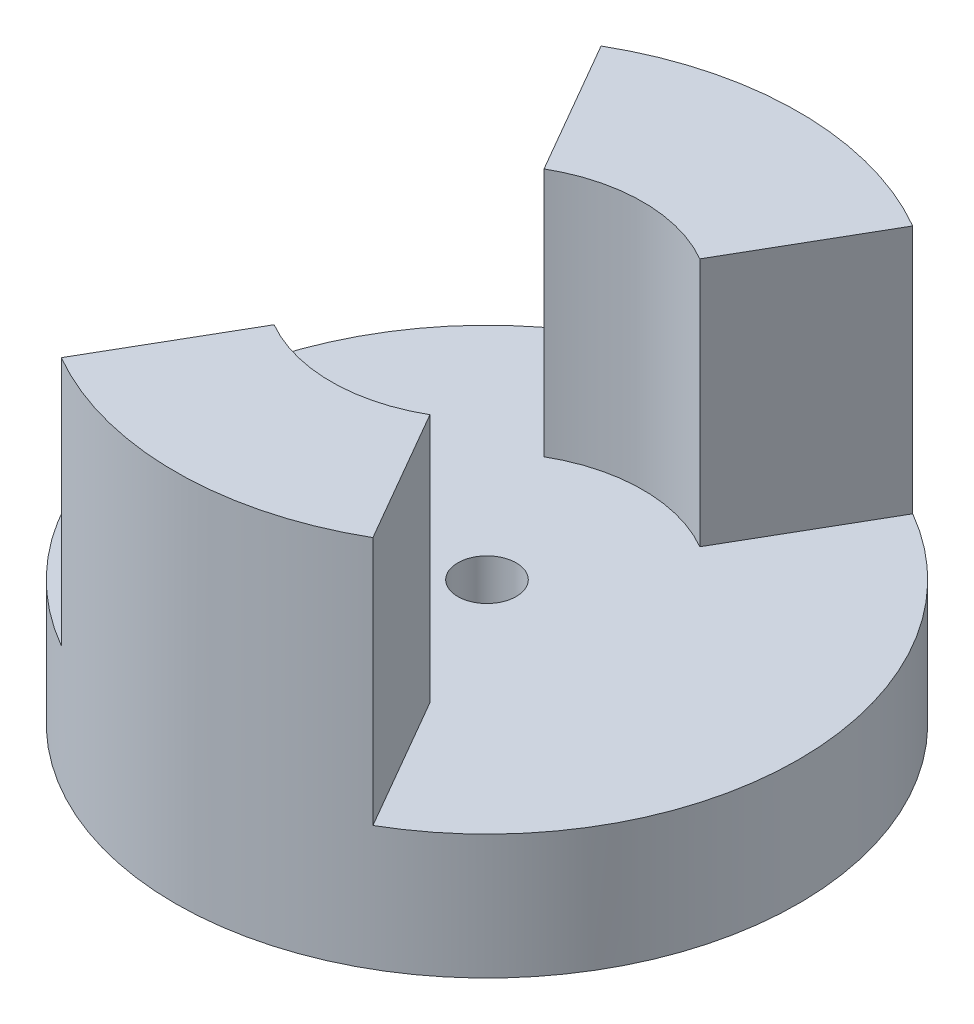
ISO-10303-21;
HEADER;
FILE_DESCRIPTION(('STEP AP214'),'2;1');
FILE_NAME('part.step','',(''),(''),'','','');
FILE_SCHEMA(('AUTOMOTIVE_DESIGN { 1 0 10303 214 1 1 1 1 }'));
ENDSEC;
DATA;
#1=APPLICATION_CONTEXT('core data for automotive mechanical design processes');
#2=APPLICATION_PROTOCOL_DEFINITION('international standard','automotive_design',2000,#1);
#3=PRODUCT_CONTEXT('',#1,'mechanical');
#4=PRODUCT('Part','Part','',(#3));
#5=PRODUCT_RELATED_PRODUCT_CATEGORY('part','',(#4));
#6=PRODUCT_DEFINITION_FORMATION('','',#4);
#7=PRODUCT_DEFINITION_CONTEXT('part definition',#1,'design');
#8=PRODUCT_DEFINITION('design','',#6,#7);
#9=PRODUCT_DEFINITION_SHAPE('','',#8);
#10=(LENGTH_UNIT() NAMED_UNIT(*) SI_UNIT(.MILLI.,.METRE.));
#11=(NAMED_UNIT(*) PLANE_ANGLE_UNIT() SI_UNIT($,.RADIAN.));
#12=(NAMED_UNIT(*) SI_UNIT($,.STERADIAN.) SOLID_ANGLE_UNIT());
#13=UNCERTAINTY_MEASURE_WITH_UNIT(LENGTH_MEASURE(1.E-05),#10,'distance_accuracy_value','');
#14=(GEOMETRIC_REPRESENTATION_CONTEXT(3) GLOBAL_UNCERTAINTY_ASSIGNED_CONTEXT((#13)) GLOBAL_UNIT_ASSIGNED_CONTEXT((#10,
#11,#12)) REPRESENTATION_CONTEXT('',''));
#15=CARTESIAN_POINT('',(0.,0.,0.));
#16=DIRECTION('',(0.,0.,1.));
#17=DIRECTION('',(1.,0.,0.));
#18=AXIS2_PLACEMENT_3D('',#15,#16,#17);
#19=CARTESIAN_POINT('',(0.,7.62,0.));
#20=DIRECTION('',(0.,-1.,0.));
#21=DIRECTION('',(0.,0.,-1.));
#22=AXIS2_PLACEMENT_3D('',#19,#20,#21);
#23=CYLINDRICAL_SURFACE('',#22,6.35);
#24=CARTESIAN_POINT('',(0.,0.,0.));
#25=DIRECTION('',(0.,1.,0.));
#26=DIRECTION('',(0.,0.,1.));
#27=AXIS2_PLACEMENT_3D('',#24,#25,#26);
#28=CIRCLE('',#27,6.35);
#29=CARTESIAN_POINT('',(0.,0.,6.35));
#30=VERTEX_POINT('',#29);
#31=EDGE_CURVE('E131',#30,#30,#28,.T.);
#32=ORIENTED_EDGE('',*,*,#31,.T.);
#33=EDGE_LOOP('',(#32));
#34=FACE_BOUND('',#33,.T.);
#35=DIRECTION('',(0.,-1.,0.));
#36=VECTOR('',#35,1.);
#37=CARTESIAN_POINT('',(3.17500000000001,7.62,-5.49926131403118));
#38=LINE('',#37,#36);
#39=CARTESIAN_POINT('',(3.17500000000001,2.54,-5.49926131403118));
#40=VERTEX_POINT('',#39);
#41=CARTESIAN_POINT('',(3.17500000000001,7.62,-5.49926131403118));
#42=VERTEX_POINT('',#41);
#43=EDGE_CURVE('E102',#40,#42,#38,.F.);
#44=ORIENTED_EDGE('',*,*,#43,.F.);
#45=CARTESIAN_POINT('',(0.,2.54,0.));
#46=DIRECTION('',(0.,-1.,0.));
#47=DIRECTION('',(0.,0.,-1.));
#48=AXIS2_PLACEMENT_3D('',#45,#46,#47);
#49=CIRCLE('',#48,6.35);
#50=CARTESIAN_POINT('',(3.17500000000002,2.54,5.49926131403118));
#51=VERTEX_POINT('',#50);
#52=EDGE_CURVE('E178',#40,#51,#49,.T.);
#53=ORIENTED_EDGE('',*,*,#52,.T.);
#54=DIRECTION('',(0.,-1.,0.));
#55=VECTOR('',#54,1.);
#56=CARTESIAN_POINT('',(3.17500000000001,7.62,5.49926131403118));
#57=LINE('',#56,#55);
#58=CARTESIAN_POINT('',(3.17500000000002,7.62,5.49926131403118));
#59=VERTEX_POINT('',#58);
#60=EDGE_CURVE('E177',#59,#51,#57,.T.);
#61=ORIENTED_EDGE('',*,*,#60,.F.);
#62=CARTESIAN_POINT('',(0.,7.62,0.));
#63=DIRECTION('',(0.,1.,0.));
#64=DIRECTION('',(0.,0.,1.));
#65=AXIS2_PLACEMENT_3D('',#62,#63,#64);
#66=CIRCLE('',#65,6.35);
#67=CARTESIAN_POINT('',(-3.17500000000002,7.62,5.49926131403118));
#68=VERTEX_POINT('',#67);
#69=EDGE_CURVE('E133',#68,#59,#66,.T.);
#70=ORIENTED_EDGE('',*,*,#69,.F.);
#71=DIRECTION('',(0.,-1.,0.));
#72=VECTOR('',#71,1.);
#73=CARTESIAN_POINT('',(-3.17500000000001,7.62,5.49926131403118));
#74=LINE('',#73,#72);
#75=CARTESIAN_POINT('',(-3.17500000000002,2.54,5.49926131403118));
#76=VERTEX_POINT('',#75);
#77=EDGE_CURVE('E123',#68,#76,#74,.T.);
#78=ORIENTED_EDGE('',*,*,#77,.T.);
#79=CARTESIAN_POINT('',(0.,2.54,0.));
#80=DIRECTION('',(0.,-1.,0.));
#81=DIRECTION('',(0.,0.,-1.));
#82=AXIS2_PLACEMENT_3D('',#79,#80,#81);
#83=CIRCLE('',#82,6.35);
#84=CARTESIAN_POINT('',(-3.17500000000001,2.54,-5.49926131403118));
#85=VERTEX_POINT('',#84);
#86=EDGE_CURVE('E172',#76,#85,#83,.T.);
#87=ORIENTED_EDGE('',*,*,#86,.T.);
#88=DIRECTION('',(0.,-1.,0.));
#89=VECTOR('',#88,1.);
#90=CARTESIAN_POINT('',(-3.17500000000001,7.62,-5.49926131403118));
#91=LINE('',#90,#89);
#92=CARTESIAN_POINT('',(-3.17500000000001,7.62,-5.49926131403118));
#93=VERTEX_POINT('',#92);
#94=EDGE_CURVE('E119',#85,#93,#91,.F.);
#95=ORIENTED_EDGE('',*,*,#94,.T.);
#96=EDGE_CURVE('E137',#42,#93,#66,.T.);
#97=ORIENTED_EDGE('',*,*,#96,.F.);
#98=EDGE_LOOP('',(#44,#53,#61,#70,#78,#87,#95,#97));
#99=FACE_BOUND('',#98,.T.);
#100=ADVANCED_FACE('F35',(#34,#99),#23,.T.);
#101=CARTESIAN_POINT('',(0.,7.62,0.));
#102=DIRECTION('',(0.,1.,0.));
#103=DIRECTION('',(0.,0.,1.));
#104=AXIS2_PLACEMENT_3D('',#101,#102,#103);
#105=PLANE('',#104);
#106=CARTESIAN_POINT('',(0.,7.62,0.));
#107=DIRECTION('',(0.,1.,0.));
#108=DIRECTION('',(0.,0.,1.));
#109=AXIS2_PLACEMENT_3D('',#106,#107,#108);
#110=CIRCLE('',#109,3.175);
#111=CARTESIAN_POINT('',(1.5875,7.62,-2.74963065701559));
#112=VERTEX_POINT('',#111);
#113=CARTESIAN_POINT('',(-1.5875,7.62,-2.74963065701559));
#114=VERTEX_POINT('',#113);
#115=EDGE_CURVE('E111',#112,#114,#110,.T.);
#116=ORIENTED_EDGE('',*,*,#115,.F.);
#117=DIRECTION('',(0.500000000000001,0.,-0.866025403784438));
#118=VECTOR('',#117,1.);
#119=CARTESIAN_POINT('',(7.62000000000001,7.62,-13.1982271536748));
#120=LINE('',#119,#118);
#121=EDGE_CURVE('E97',#112,#42,#120,.T.);
#122=ORIENTED_EDGE('',*,*,#121,.T.);
#123=ORIENTED_EDGE('',*,*,#96,.T.);
#124=DIRECTION('',(-0.500000000000001,0.,-0.866025403784438));
#125=VECTOR('',#124,1.);
#126=CARTESIAN_POINT('',(-7.62000000000001,7.62,-13.1982271536748));
#127=LINE('',#126,#125);
#128=EDGE_CURVE('E117',#114,#93,#127,.T.);
#129=ORIENTED_EDGE('',*,*,#128,.F.);
#130=EDGE_LOOP('',(#116,#122,#123,#129));
#131=FACE_BOUND('',#130,.T.);
#132=ADVANCED_FACE('F115',(#131),#105,.T.);
#133=ORIENTED_EDGE('',*,*,#69,.T.);
#134=DIRECTION('',(-0.500000000000002,0.,-0.866025403784437));
#135=VECTOR('',#134,1.);
#136=CARTESIAN_POINT('',(0.,7.62,0.));
#137=LINE('',#136,#135);
#138=CARTESIAN_POINT('',(1.58750000000001,7.62,2.74963065701559));
#139=VERTEX_POINT('',#138);
#140=EDGE_CURVE('E106',#59,#139,#137,.T.);
#141=ORIENTED_EDGE('',*,*,#140,.T.);
#142=CARTESIAN_POINT('',(-1.58750000000001,7.62,2.74963065701559));
#143=VERTEX_POINT('',#142);
#144=EDGE_CURVE('E118',#143,#139,#110,.T.);
#145=ORIENTED_EDGE('',*,*,#144,.F.);
#146=DIRECTION('',(0.500000000000002,0.,-0.866025403784437));
#147=VECTOR('',#146,1.);
#148=CARTESIAN_POINT('',(0.,7.62,0.));
#149=LINE('',#148,#147);
#150=EDGE_CURVE('E164',#68,#143,#149,.T.);
#151=ORIENTED_EDGE('',*,*,#150,.F.);
#152=EDGE_LOOP('',(#133,#141,#145,#151));
#153=FACE_BOUND('',#152,.T.);
#154=ADVANCED_FACE('F156',(#153),#105,.T.);
#155=CARTESIAN_POINT('',(0.,2.54,0.));
#156=DIRECTION('',(0.,1.,0.));
#157=DIRECTION('',(0.,0.,1.));
#158=AXIS2_PLACEMENT_3D('',#155,#156,#157);
#159=CYLINDRICAL_SURFACE('',#158,3.175);
#160=DIRECTION('',(0.,1.,0.));
#161=VECTOR('',#160,1.);
#162=CARTESIAN_POINT('',(1.5875,2.54,-2.74963065701559));
#163=LINE('',#162,#161);
#164=CARTESIAN_POINT('',(1.5875,2.54,-2.74963065701559));
#165=VERTEX_POINT('',#164);
#166=EDGE_CURVE('E11',#112,#165,#163,.F.);
#167=ORIENTED_EDGE('',*,*,#166,.F.);
#168=ORIENTED_EDGE('',*,*,#115,.T.);
#169=DIRECTION('',(0.,1.,0.));
#170=VECTOR('',#169,1.);
#171=CARTESIAN_POINT('',(-1.5875,2.54,-2.74963065701559));
#172=LINE('',#171,#170);
#173=CARTESIAN_POINT('',(-1.5875,2.54,-2.74963065701559));
#174=VERTEX_POINT('',#173);
#175=EDGE_CURVE('E144',#114,#174,#172,.F.);
#176=ORIENTED_EDGE('',*,*,#175,.T.);
#177=CARTESIAN_POINT('',(0.,2.54,0.));
#178=DIRECTION('',(0.,1.,0.));
#179=DIRECTION('',(0.,0.,1.));
#180=AXIS2_PLACEMENT_3D('',#177,#178,#179);
#181=CIRCLE('',#180,3.175);
#182=EDGE_CURVE('E113',#165,#174,#181,.T.);
#183=ORIENTED_EDGE('',*,*,#182,.F.);
#184=EDGE_LOOP('',(#167,#168,#176,#183));
#185=FACE_BOUND('',#184,.T.);
#186=ADVANCED_FACE('F109',(#185),#159,.F.);
#187=DIRECTION('',(0.,1.,0.));
#188=VECTOR('',#187,1.);
#189=CARTESIAN_POINT('',(1.58750000000001,2.54,2.74963065701559));
#190=LINE('',#189,#188);
#191=CARTESIAN_POINT('',(1.58750000000001,2.54,2.74963065701559));
#192=VERTEX_POINT('',#191);
#193=EDGE_CURVE('E42',#192,#139,#190,.T.);
#194=ORIENTED_EDGE('',*,*,#193,.F.);
#195=CARTESIAN_POINT('',(-1.58750000000001,2.54,2.74963065701559));
#196=VERTEX_POINT('',#195);
#197=EDGE_CURVE('E127',#196,#192,#181,.T.);
#198=ORIENTED_EDGE('',*,*,#197,.F.);
#199=DIRECTION('',(0.,1.,0.));
#200=VECTOR('',#199,1.);
#201=CARTESIAN_POINT('',(-1.58750000000001,2.54,2.74963065701559));
#202=LINE('',#201,#200);
#203=EDGE_CURVE('E136',#196,#143,#202,.T.);
#204=ORIENTED_EDGE('',*,*,#203,.T.);
#205=ORIENTED_EDGE('',*,*,#144,.T.);
#206=EDGE_LOOP('',(#194,#198,#204,#205));
#207=FACE_BOUND('',#206,.T.);
#208=ADVANCED_FACE('F160',(#207),#159,.F.);
#209=CARTESIAN_POINT('',(0.,7.62,0.));
#210=DIRECTION('',(0.,1.,0.));
#211=DIRECTION('',(0.,0.,1.));
#212=AXIS2_PLACEMENT_3D('',#209,#210,#211);
#213=CYLINDRICAL_SURFACE('',#212,0.595629999999993);
#214=CARTESIAN_POINT('',(0.,0.,0.));
#215=DIRECTION('',(0.,1.,0.));
#216=DIRECTION('',(0.,0.,1.));
#217=AXIS2_PLACEMENT_3D('',#214,#215,#216);
#218=CIRCLE('',#217,0.595629999999998);
#219=CARTESIAN_POINT('',(0.,0.,0.595629999999998));
#220=VERTEX_POINT('',#219);
#221=EDGE_CURVE('E128',#220,#220,#218,.T.);
#222=ORIENTED_EDGE('',*,*,#221,.F.);
#223=EDGE_LOOP('',(#222));
#224=FACE_BOUND('',#223,.T.);
#225=CARTESIAN_POINT('',(0.,2.54,0.));
#226=DIRECTION('',(0.,1.,0.));
#227=DIRECTION('',(0.,0.,1.));
#228=AXIS2_PLACEMENT_3D('',#225,#226,#227);
#229=CIRCLE('',#228,0.595629999999993);
#230=CARTESIAN_POINT('',(0.,2.54,0.595629999999993));
#231=VERTEX_POINT('',#230);
#232=EDGE_CURVE('E132',#231,#231,#229,.F.);
#233=ORIENTED_EDGE('',*,*,#232,.F.);
#234=EDGE_LOOP('',(#233));
#235=FACE_BOUND('',#234,.T.);
#236=ADVANCED_FACE('F194',(#224,#235),#213,.F.);
#237=CARTESIAN_POINT('',(0.,0.,0.));
#238=DIRECTION('',(0.,1.,0.));
#239=DIRECTION('',(0.,0.,1.));
#240=AXIS2_PLACEMENT_3D('',#237,#238,#239);
#241=PLANE('',#240);
#242=ORIENTED_EDGE('',*,*,#221,.T.);
#243=EDGE_LOOP('',(#242));
#244=FACE_BOUND('',#243,.T.);
#245=ORIENTED_EDGE('',*,*,#31,.F.);
#246=EDGE_LOOP('',(#245));
#247=FACE_BOUND('',#246,.T.);
#248=ADVANCED_FACE('F190',(#244,#247),#241,.F.);
#249=CARTESIAN_POINT('',(0.,2.54,0.));
#250=DIRECTION('',(0.,1.,0.));
#251=DIRECTION('',(0.,0.,1.));
#252=AXIS2_PLACEMENT_3D('',#249,#250,#251);
#253=PLANE('',#252);
#254=DIRECTION('',(0.500000000000001,0.,-0.866025403784438));
#255=VECTOR('',#254,1.);
#256=CARTESIAN_POINT('',(7.62000000000001,2.54,-13.1982271536748));
#257=LINE('',#256,#255);
#258=EDGE_CURVE('E49',#165,#40,#257,.T.);
#259=ORIENTED_EDGE('',*,*,#258,.F.);
#260=ORIENTED_EDGE('',*,*,#182,.T.);
#261=DIRECTION('',(-0.500000000000001,0.,-0.866025403784438));
#262=VECTOR('',#261,1.);
#263=CARTESIAN_POINT('',(-7.62000000000001,2.54,-13.1982271536748));
#264=LINE('',#263,#262);
#265=EDGE_CURVE('E165',#174,#85,#264,.T.);
#266=ORIENTED_EDGE('',*,*,#265,.T.);
#267=ORIENTED_EDGE('',*,*,#86,.F.);
#268=DIRECTION('',(0.500000000000002,0.,-0.866025403784437));
#269=VECTOR('',#268,1.);
#270=CARTESIAN_POINT('',(0.,2.54,0.));
#271=LINE('',#270,#269);
#272=EDGE_CURVE('E55',#76,#196,#271,.T.);
#273=ORIENTED_EDGE('',*,*,#272,.T.);
#274=ORIENTED_EDGE('',*,*,#197,.T.);
#275=DIRECTION('',(-0.500000000000002,0.,-0.866025403784437));
#276=VECTOR('',#275,1.);
#277=CARTESIAN_POINT('',(0.,2.54,0.));
#278=LINE('',#277,#276);
#279=EDGE_CURVE('E151',#51,#192,#278,.T.);
#280=ORIENTED_EDGE('',*,*,#279,.F.);
#281=ORIENTED_EDGE('',*,*,#52,.F.);
#282=EDGE_LOOP('',(#259,#260,#266,#267,#273,#274,#280,#281));
#283=FACE_BOUND('',#282,.T.);
#284=ORIENTED_EDGE('',*,*,#232,.T.);
#285=EDGE_LOOP('',(#284));
#286=FACE_BOUND('',#285,.T.);
#287=ADVANCED_FACE('F187',(#283,#286),#253,.T.);
#288=CARTESIAN_POINT('',(-7.62000000000001,2.54,-13.1982271536748));
#289=DIRECTION('',(0.866025403784438,0.,-0.500000000000001));
#290=DIRECTION('',(-0.500000000000001,0.,-0.866025403784438));
#291=AXIS2_PLACEMENT_3D('',#288,#289,#290);
#292=PLANE('',#291);
#293=ORIENTED_EDGE('',*,*,#265,.F.);
#294=ORIENTED_EDGE('',*,*,#175,.F.);
#295=ORIENTED_EDGE('',*,*,#128,.T.);
#296=ORIENTED_EDGE('',*,*,#94,.F.);
#297=EDGE_LOOP('',(#293,#294,#295,#296));
#298=FACE_BOUND('',#297,.T.);
#299=ADVANCED_FACE('F186',(#298),#292,.F.);
#300=CARTESIAN_POINT('',(0.,2.54,0.));
#301=DIRECTION('',(0.866025403784437,0.,0.500000000000002));
#302=DIRECTION('',(0.500000000000002,0.,-0.866025403784437));
#303=AXIS2_PLACEMENT_3D('',#300,#301,#302);
#304=PLANE('',#303);
#305=ORIENTED_EDGE('',*,*,#150,.T.);
#306=ORIENTED_EDGE('',*,*,#203,.F.);
#307=ORIENTED_EDGE('',*,*,#272,.F.);
#308=ORIENTED_EDGE('',*,*,#77,.F.);
#309=EDGE_LOOP('',(#305,#306,#307,#308));
#310=FACE_BOUND('',#309,.T.);
#311=ADVANCED_FACE('F162',(#310),#304,.F.);
#312=CARTESIAN_POINT('',(7.62000000000001,2.54,-13.1982271536748));
#313=DIRECTION('',(0.866025403784438,0.,0.500000000000001));
#314=DIRECTION('',(0.500000000000001,0.,-0.866025403784438));
#315=AXIS2_PLACEMENT_3D('',#312,#313,#314);
#316=PLANE('',#315);
#317=ORIENTED_EDGE('',*,*,#43,.T.);
#318=ORIENTED_EDGE('',*,*,#121,.F.);
#319=ORIENTED_EDGE('',*,*,#166,.T.);
#320=ORIENTED_EDGE('',*,*,#258,.T.);
#321=EDGE_LOOP('',(#317,#318,#319,#320));
#322=FACE_BOUND('',#321,.T.);
#323=ADVANCED_FACE('F99',(#322),#316,.T.);
#324=CARTESIAN_POINT('',(0.,2.54,0.));
#325=DIRECTION('',(0.866025403784437,0.,-0.500000000000002));
#326=DIRECTION('',(-0.500000000000002,0.,-0.866025403784437));
#327=AXIS2_PLACEMENT_3D('',#324,#325,#326);
#328=PLANE('',#327);
#329=ORIENTED_EDGE('',*,*,#60,.T.);
#330=ORIENTED_EDGE('',*,*,#279,.T.);
#331=ORIENTED_EDGE('',*,*,#193,.T.);
#332=ORIENTED_EDGE('',*,*,#140,.F.);
#333=EDGE_LOOP('',(#329,#330,#331,#332));
#334=FACE_BOUND('',#333,.T.);
#335=ADVANCED_FACE('F148',(#334),#328,.T.);
#336=CLOSED_SHELL('',(#100,#132,#154,#186,#208,#236,#248,#287,#299,#311,#323,#335));
#337=MANIFOLD_SOLID_BREP('B2',#336);
#338=ADVANCED_BREP_SHAPE_REPRESENTATION('',(#18,#337),#14);
#339=SHAPE_DEFINITION_REPRESENTATION(#9,#338);
ENDSEC;
END-ISO-10303-21;
